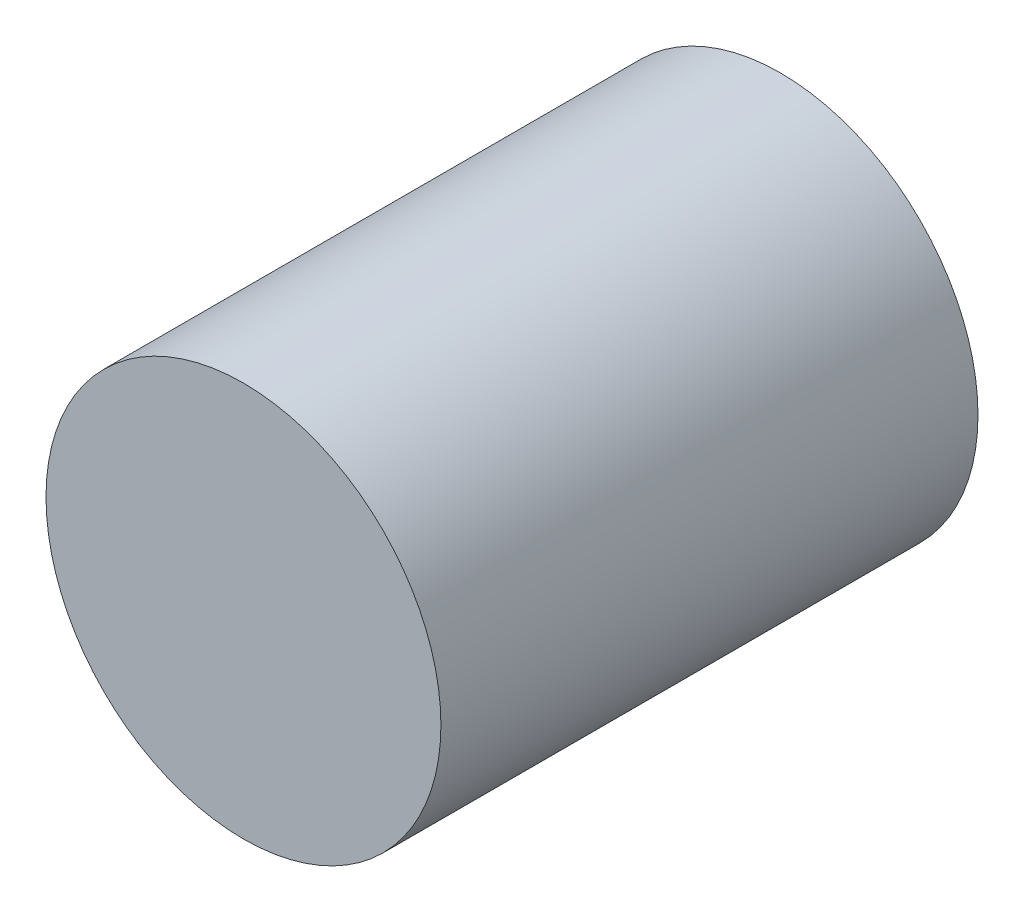
ISO-10303-21;
HEADER;
FILE_DESCRIPTION(('STEP AP214'),'2;1');
FILE_NAME('part.step','',(''),(''),'','','');
FILE_SCHEMA(('AUTOMOTIVE_DESIGN { 1 0 10303 214 1 1 1 1 }'));
ENDSEC;
DATA;
#1=APPLICATION_CONTEXT('core data for automotive mechanical design processes');
#2=APPLICATION_PROTOCOL_DEFINITION('international standard','automotive_design',2000,#1);
#3=PRODUCT_CONTEXT('',#1,'mechanical');
#4=PRODUCT('Part','Part','',(#3));
#5=PRODUCT_RELATED_PRODUCT_CATEGORY('part','',(#4));
#6=PRODUCT_DEFINITION_FORMATION('','',#4);
#7=PRODUCT_DEFINITION_CONTEXT('part definition',#1,'design');
#8=PRODUCT_DEFINITION('design','',#6,#7);
#9=PRODUCT_DEFINITION_SHAPE('','',#8);
#10=(LENGTH_UNIT() NAMED_UNIT(*) SI_UNIT(.MILLI.,.METRE.));
#11=(NAMED_UNIT(*) PLANE_ANGLE_UNIT() SI_UNIT($,.RADIAN.));
#12=(NAMED_UNIT(*) SI_UNIT($,.STERADIAN.) SOLID_ANGLE_UNIT());
#13=UNCERTAINTY_MEASURE_WITH_UNIT(LENGTH_MEASURE(1.E-05),#10,'distance_accuracy_value','');
#14=(GEOMETRIC_REPRESENTATION_CONTEXT(3) GLOBAL_UNCERTAINTY_ASSIGNED_CONTEXT((#13)) GLOBAL_UNIT_ASSIGNED_CONTEXT((#10,
#11,#12)) REPRESENTATION_CONTEXT('',''));
#15=CARTESIAN_POINT('',(0.,0.,0.));
#16=DIRECTION('',(0.,0.,1.));
#17=DIRECTION('',(1.,0.,0.));
#18=AXIS2_PLACEMENT_3D('',#15,#16,#17);
#19=CARTESIAN_POINT('',(0.,0.,34.));
#20=DIRECTION('',(0.,0.,-1.));
#21=DIRECTION('',(-1.,0.,0.));
#22=AXIS2_PLACEMENT_3D('',#19,#20,#21);
#23=CYLINDRICAL_SURFACE('',#22,12.5);
#24=CARTESIAN_POINT('',(0.,0.,34.));
#25=DIRECTION('',(0.,0.,1.));
#26=DIRECTION('',(1.,0.,0.));
#27=AXIS2_PLACEMENT_3D('',#24,#25,#26);
#28=CIRCLE('',#27,12.5);
#29=CARTESIAN_POINT('',(12.5,0.,34.));
#30=VERTEX_POINT('',#29);
#31=EDGE_CURVE('E10',#30,#30,#28,.T.);
#32=ORIENTED_EDGE('',*,*,#31,.F.);
#33=EDGE_LOOP('',(#32));
#34=FACE_BOUND('',#33,.T.);
#35=CARTESIAN_POINT('',(0.,0.,0.));
#36=DIRECTION('',(0.,0.,1.));
#37=DIRECTION('',(1.,0.,0.));
#38=AXIS2_PLACEMENT_3D('',#35,#36,#37);
#39=CIRCLE('',#38,12.5);
#40=CARTESIAN_POINT('',(12.5,0.,0.));
#41=VERTEX_POINT('',#40);
#42=EDGE_CURVE('E33',#41,#41,#39,.T.);
#43=ORIENTED_EDGE('',*,*,#42,.T.);
#44=EDGE_LOOP('',(#43));
#45=FACE_BOUND('',#44,.T.);
#46=ADVANCED_FACE('F30',(#34,#45),#23,.T.);
#47=CARTESIAN_POINT('',(0.,0.,34.));
#48=DIRECTION('',(0.,0.,1.));
#49=DIRECTION('',(1.,0.,0.));
#50=AXIS2_PLACEMENT_3D('',#47,#48,#49);
#51=PLANE('',#50);
#52=ORIENTED_EDGE('',*,*,#31,.T.);
#53=EDGE_LOOP('',(#52));
#54=FACE_BOUND('',#53,.T.);
#55=ADVANCED_FACE('F45',(#54),#51,.T.);
#56=CARTESIAN_POINT('',(0.,0.,0.));
#57=DIRECTION('',(0.,0.,1.));
#58=DIRECTION('',(1.,0.,0.));
#59=AXIS2_PLACEMENT_3D('',#56,#57,#58);
#60=PLANE('',#59);
#61=ORIENTED_EDGE('',*,*,#42,.F.);
#62=EDGE_LOOP('',(#61));
#63=FACE_BOUND('',#62,.T.);
#64=ADVANCED_FACE('F43',(#63),#60,.F.);
#65=CLOSED_SHELL('',(#46,#55,#64));
#66=MANIFOLD_SOLID_BREP('B2',#65);
#67=ADVANCED_BREP_SHAPE_REPRESENTATION('',(#18,#66),#14);
#68=SHAPE_DEFINITION_REPRESENTATION(#9,#67);
ENDSEC;
END-ISO-10303-21;
